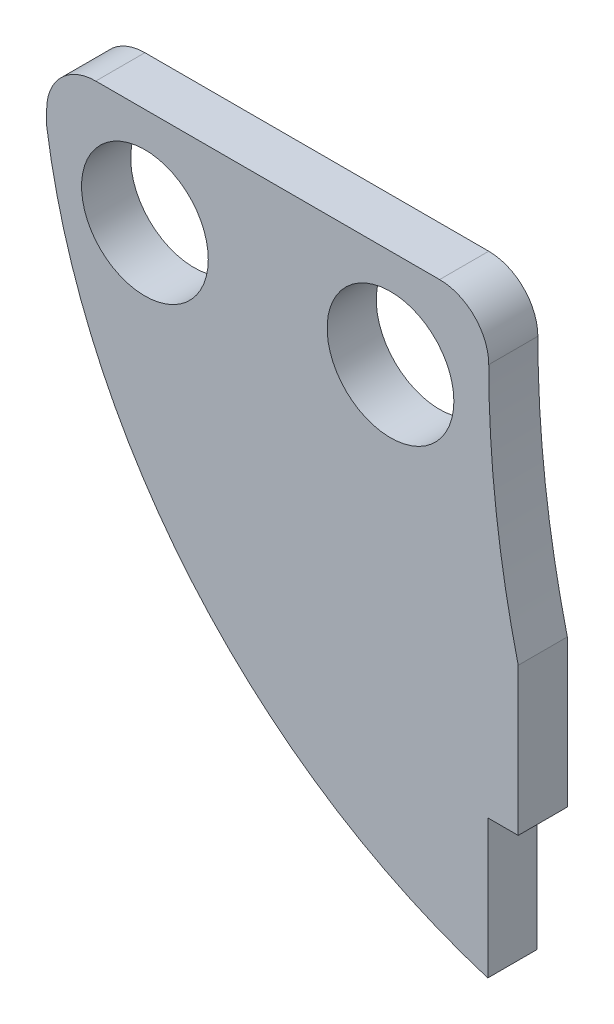
ISO-10303-21;
HEADER;
FILE_DESCRIPTION(('STEP AP214'),'2;1');
FILE_NAME('part.step','',(''),(''),'','','');
FILE_SCHEMA(('AUTOMOTIVE_DESIGN { 1 0 10303 214 1 1 1 1 }'));
ENDSEC;
DATA;
#1=APPLICATION_CONTEXT('core data for automotive mechanical design processes');
#2=APPLICATION_PROTOCOL_DEFINITION('international standard','automotive_design',2000,#1);
#3=PRODUCT_CONTEXT('',#1,'mechanical');
#4=PRODUCT('Part','Part','',(#3));
#5=PRODUCT_RELATED_PRODUCT_CATEGORY('part','',(#4));
#6=PRODUCT_DEFINITION_FORMATION('','',#4);
#7=PRODUCT_DEFINITION_CONTEXT('part definition',#1,'design');
#8=PRODUCT_DEFINITION('design','',#6,#7);
#9=PRODUCT_DEFINITION_SHAPE('','',#8);
#10=(LENGTH_UNIT() NAMED_UNIT(*) SI_UNIT(.MILLI.,.METRE.));
#11=(NAMED_UNIT(*) PLANE_ANGLE_UNIT() SI_UNIT($,.RADIAN.));
#12=(NAMED_UNIT(*) SI_UNIT($,.STERADIAN.) SOLID_ANGLE_UNIT());
#13=UNCERTAINTY_MEASURE_WITH_UNIT(LENGTH_MEASURE(1.E-05),#10,'distance_accuracy_value','');
#14=(GEOMETRIC_REPRESENTATION_CONTEXT(3) GLOBAL_UNCERTAINTY_ASSIGNED_CONTEXT((#13)) GLOBAL_UNIT_ASSIGNED_CONTEXT((#10,
#11,#12)) REPRESENTATION_CONTEXT('',''));
#15=CARTESIAN_POINT('',(0.,0.,0.));
#16=DIRECTION('',(0.,0.,1.));
#17=DIRECTION('',(1.,0.,0.));
#18=AXIS2_PLACEMENT_3D('',#15,#16,#17);
#19=CARTESIAN_POINT('',(38.7754736804659,5.55781789420011,5.));
#20=DIRECTION('',(0.,0.,1.));
#21=DIRECTION('',(1.,0.,0.));
#22=AXIS2_PLACEMENT_3D('',#19,#20,#21);
#23=PLANE('',#22);
#24=CARTESIAN_POINT('',(-15.3493449781659,-7.18340611353712,5.));
#25=DIRECTION('',(0.,0.,1.));
#26=DIRECTION('',(1.,0.,0.));
#27=AXIS2_PLACEMENT_3D('',#24,#25,#26);
#28=CIRCLE('',#27,6.45);
#29=CARTESIAN_POINT('',(-8.89934497816594,-7.18340611353712,5.));
#30=VERTEX_POINT('',#29);
#31=EDGE_CURVE('E187',#30,#30,#28,.T.);
#32=ORIENTED_EDGE('',*,*,#31,.F.);
#33=EDGE_LOOP('',(#32));
#34=FACE_BOUND('',#33,.T.);
#35=CARTESIAN_POINT('',(9.65065502183406,-7.18340611353712,5.));
#36=DIRECTION('',(0.,0.,1.));
#37=DIRECTION('',(1.,0.,0.));
#38=AXIS2_PLACEMENT_3D('',#35,#36,#37);
#39=CIRCLE('',#38,6.45);
#40=CARTESIAN_POINT('',(16.1006550218341,-7.18340611353712,5.));
#41=VERTEX_POINT('',#40);
#42=EDGE_CURVE('E135',#41,#41,#39,.T.);
#43=ORIENTED_EDGE('',*,*,#42,.F.);
#44=EDGE_LOOP('',(#43));
#45=FACE_BOUND('',#44,.T.);
#46=DIRECTION('',(-1.,0.,0.));
#47=VECTOR('',#46,1.);
#48=CARTESIAN_POINT('',(-25.3493449781659,2.81659388646288,5.));
#49=LINE('',#48,#47);
#50=CARTESIAN_POINT('',(14.650655021834,2.81659388646288,5.));
#51=VERTEX_POINT('',#50);
#52=CARTESIAN_POINT('',(-20.3493449781659,2.81659388646288,5.));
#53=VERTEX_POINT('',#52);
#54=EDGE_CURVE('E145',#51,#53,#49,.T.);
#55=ORIENTED_EDGE('',*,*,#54,.T.);
#56=CARTESIAN_POINT('',(-20.3493449781659,-2.18340611353712,5.));
#57=DIRECTION('',(0.,0.,1.));
#58=DIRECTION('',(1.,0.,0.));
#59=AXIS2_PLACEMENT_3D('',#56,#57,#58);
#60=CIRCLE('',#59,5.);
#61=CARTESIAN_POINT('',(-25.3493449781659,-2.18340611353712,5.));
#62=VERTEX_POINT('',#61);
#63=EDGE_CURVE('E11',#53,#62,#60,.T.);
#64=ORIENTED_EDGE('',*,*,#63,.T.);
#65=DIRECTION('',(0.,-1.,0.));
#66=VECTOR('',#65,1.);
#67=CARTESIAN_POINT('',(-25.3493449781659,-3.63340611353712,5.));
#68=LINE('',#67,#66);
#69=CARTESIAN_POINT('',(-25.3493449781659,-3.63340611353712,5.));
#70=VERTEX_POINT('',#69);
#71=EDGE_CURVE('E128',#62,#70,#68,.T.);
#72=ORIENTED_EDGE('',*,*,#71,.T.);
#73=CARTESIAN_POINT('',(38.7754736804659,5.55781789420011,5.));
#74=DIRECTION('',(0.,0.,1.));
#75=DIRECTION('',(1.,0.,0.));
#76=AXIS2_PLACEMENT_3D('',#73,#74,#75);
#77=CIRCLE('',#76,64.7801741797815);
#78=CARTESIAN_POINT('',(19.5506550218341,-56.3039418148928,5.));
#79=VERTEX_POINT('',#78);
#80=EDGE_CURVE('E124',#70,#79,#77,.T.);
#81=ORIENTED_EDGE('',*,*,#80,.T.);
#82=DIRECTION('',(0.,-1.,0.));
#83=VECTOR('',#82,1.);
#84=CARTESIAN_POINT('',(19.5506550218341,-42.1834061135371,5.));
#85=LINE('',#84,#83);
#86=CARTESIAN_POINT('',(19.5506550218341,-42.1834061135371,5.));
#87=VERTEX_POINT('',#86);
#88=EDGE_CURVE('E117',#87,#79,#85,.T.);
#89=ORIENTED_EDGE('',*,*,#88,.F.);
#90=DIRECTION('',(1.,0.,0.));
#91=VECTOR('',#90,1.);
#92=CARTESIAN_POINT('',(22.6506550218341,-42.1834061135371,5.));
#93=LINE('',#92,#91);
#94=CARTESIAN_POINT('',(22.6506550218341,-42.1834061135371,5.));
#95=VERTEX_POINT('',#94);
#96=EDGE_CURVE('E106',#87,#95,#93,.T.);
#97=ORIENTED_EDGE('',*,*,#96,.T.);
#98=DIRECTION('',(0.,1.,0.));
#99=VECTOR('',#98,1.);
#100=CARTESIAN_POINT('',(22.6506550218341,-27.1834061135371,5.));
#101=LINE('',#100,#99);
#102=CARTESIAN_POINT('',(22.6506550218341,-27.1834061135371,5.));
#103=VERTEX_POINT('',#102);
#104=EDGE_CURVE('E114',#95,#103,#101,.T.);
#105=ORIENTED_EDGE('',*,*,#104,.T.);
#106=CARTESIAN_POINT('',(125.317321688501,-2.18340611353712,5.));
#107=DIRECTION('',(0.,0.,-1.));
#108=DIRECTION('',(1.,0.,0.));
#109=AXIS2_PLACEMENT_3D('',#106,#107,#108);
#110=CIRCLE('',#109,105.666666666667);
#111=CARTESIAN_POINT('',(19.6506550218341,-2.1834061135371,5.));
#112=VERTEX_POINT('',#111);
#113=EDGE_CURVE('E123',#103,#112,#110,.T.);
#114=ORIENTED_EDGE('',*,*,#113,.T.);
#115=CARTESIAN_POINT('',(14.6506550218341,-2.18340611353712,5.));
#116=DIRECTION('',(0.,0.,1.));
#117=DIRECTION('',(1.,0.,0.));
#118=AXIS2_PLACEMENT_3D('',#115,#116,#117);
#119=CIRCLE('',#118,5.);
#120=EDGE_CURVE('E40',#112,#51,#119,.T.);
#121=ORIENTED_EDGE('',*,*,#120,.T.);
#122=EDGE_LOOP('',(#55,#64,#72,#81,#89,#97,#105,#114,#121));
#123=FACE_BOUND('',#122,.T.);
#124=ADVANCED_FACE('F32',(#34,#45,#123),#23,.T.);
#125=CARTESIAN_POINT('',(38.7754736804659,5.55781789420011,0.));
#126=DIRECTION('',(0.,0.,1.));
#127=DIRECTION('',(1.,0.,0.));
#128=AXIS2_PLACEMENT_3D('',#125,#126,#127);
#129=PLANE('',#128);
#130=CARTESIAN_POINT('',(-15.3493449781659,-7.18340611353712,0.));
#131=DIRECTION('',(0.,0.,1.));
#132=DIRECTION('',(1.,0.,0.));
#133=AXIS2_PLACEMENT_3D('',#130,#131,#132);
#134=CIRCLE('',#133,6.45);
#135=CARTESIAN_POINT('',(-8.89934497816594,-7.18340611353712,0.));
#136=VERTEX_POINT('',#135);
#137=EDGE_CURVE('E190',#136,#136,#134,.T.);
#138=ORIENTED_EDGE('',*,*,#137,.T.);
#139=EDGE_LOOP('',(#138));
#140=FACE_BOUND('',#139,.T.);
#141=CARTESIAN_POINT('',(9.65065502183406,-7.18340611353712,0.));
#142=DIRECTION('',(0.,0.,1.));
#143=DIRECTION('',(1.,0.,0.));
#144=AXIS2_PLACEMENT_3D('',#141,#142,#143);
#145=CIRCLE('',#144,6.45);
#146=CARTESIAN_POINT('',(16.1006550218341,-7.18340611353712,0.));
#147=VERTEX_POINT('',#146);
#148=EDGE_CURVE('E184',#147,#147,#145,.T.);
#149=ORIENTED_EDGE('',*,*,#148,.T.);
#150=EDGE_LOOP('',(#149));
#151=FACE_BOUND('',#150,.T.);
#152=DIRECTION('',(0.,-1.,0.));
#153=VECTOR('',#152,1.);
#154=CARTESIAN_POINT('',(-25.3493449781659,-3.63340611353712,0.));
#155=LINE('',#154,#153);
#156=CARTESIAN_POINT('',(-25.3493449781659,-2.18340611353712,0.));
#157=VERTEX_POINT('',#156);
#158=CARTESIAN_POINT('',(-25.3493449781659,-3.63340611353712,0.));
#159=VERTEX_POINT('',#158);
#160=EDGE_CURVE('E134',#157,#159,#155,.T.);
#161=ORIENTED_EDGE('',*,*,#160,.F.);
#162=CARTESIAN_POINT('',(-20.3493449781659,-2.18340611353712,0.));
#163=DIRECTION('',(0.,0.,1.));
#164=DIRECTION('',(1.,0.,0.));
#165=AXIS2_PLACEMENT_3D('',#162,#163,#164);
#166=CIRCLE('',#165,5.);
#167=CARTESIAN_POINT('',(-20.3493449781659,2.81659388646288,0.));
#168=VERTEX_POINT('',#167);
#169=EDGE_CURVE('E159',#157,#168,#166,.F.);
#170=ORIENTED_EDGE('',*,*,#169,.T.);
#171=DIRECTION('',(-1.,0.,0.));
#172=VECTOR('',#171,1.);
#173=CARTESIAN_POINT('',(-25.3493449781659,2.81659388646288,0.));
#174=LINE('',#173,#172);
#175=CARTESIAN_POINT('',(14.650655021834,2.81659388646288,0.));
#176=VERTEX_POINT('',#175);
#177=EDGE_CURVE('E132',#176,#168,#174,.T.);
#178=ORIENTED_EDGE('',*,*,#177,.F.);
#179=CARTESIAN_POINT('',(14.6506550218341,-2.18340611353712,0.));
#180=DIRECTION('',(0.,0.,1.));
#181=DIRECTION('',(1.,0.,0.));
#182=AXIS2_PLACEMENT_3D('',#179,#180,#181);
#183=CIRCLE('',#182,5.);
#184=CARTESIAN_POINT('',(19.6506550218341,-2.1834061135371,0.));
#185=VERTEX_POINT('',#184);
#186=EDGE_CURVE('E157',#176,#185,#183,.F.);
#187=ORIENTED_EDGE('',*,*,#186,.T.);
#188=CARTESIAN_POINT('',(125.317321688501,-2.18340611353712,0.));
#189=DIRECTION('',(0.,0.,-1.));
#190=DIRECTION('',(1.,0.,0.));
#191=AXIS2_PLACEMENT_3D('',#188,#189,#190);
#192=CIRCLE('',#191,105.666666666667);
#193=CARTESIAN_POINT('',(22.6506550218341,-27.1834061135371,0.));
#194=VERTEX_POINT('',#193);
#195=EDGE_CURVE('E142',#194,#185,#192,.T.);
#196=ORIENTED_EDGE('',*,*,#195,.F.);
#197=DIRECTION('',(0.,1.,0.));
#198=VECTOR('',#197,1.);
#199=CARTESIAN_POINT('',(22.6506550218341,-27.1834061135371,0.));
#200=LINE('',#199,#198);
#201=CARTESIAN_POINT('',(22.6506550218341,-42.1834061135371,0.));
#202=VERTEX_POINT('',#201);
#203=EDGE_CURVE('E140',#202,#194,#200,.T.);
#204=ORIENTED_EDGE('',*,*,#203,.F.);
#205=DIRECTION('',(-1.,0.,0.));
#206=VECTOR('',#205,1.);
#207=CARTESIAN_POINT('',(22.6506550218341,-42.1834061135371,0.));
#208=LINE('',#207,#206);
#209=CARTESIAN_POINT('',(19.5506550218341,-42.1834061135371,0.));
#210=VERTEX_POINT('',#209);
#211=EDGE_CURVE('E109',#202,#210,#208,.T.);
#212=ORIENTED_EDGE('',*,*,#211,.T.);
#213=DIRECTION('',(0.,-1.,0.));
#214=VECTOR('',#213,1.);
#215=CARTESIAN_POINT('',(19.5506550218341,-42.1834061135371,0.));
#216=LINE('',#215,#214);
#217=CARTESIAN_POINT('',(19.5506550218341,-56.3039418148928,0.));
#218=VERTEX_POINT('',#217);
#219=EDGE_CURVE('E193',#210,#218,#216,.T.);
#220=ORIENTED_EDGE('',*,*,#219,.T.);
#221=CARTESIAN_POINT('',(38.7754736804659,5.55781789420011,0.));
#222=DIRECTION('',(0.,0.,1.));
#223=DIRECTION('',(1.,0.,0.));
#224=AXIS2_PLACEMENT_3D('',#221,#222,#223);
#225=CIRCLE('',#224,64.7801741797815);
#226=EDGE_CURVE('E137',#159,#218,#225,.T.);
#227=ORIENTED_EDGE('',*,*,#226,.F.);
#228=EDGE_LOOP('',(#161,#170,#178,#187,#196,#204,#212,#220,#227));
#229=FACE_BOUND('',#228,.T.);
#230=ADVANCED_FACE('F170',(#140,#151,#229),#129,.F.);
#231=CARTESIAN_POINT('',(38.7754736804659,5.55781789420011,5.));
#232=DIRECTION('',(0.,0.,-1.));
#233=DIRECTION('',(-1.,0.,0.));
#234=AXIS2_PLACEMENT_3D('',#231,#232,#233);
#235=CYLINDRICAL_SURFACE('',#234,64.7801741797815);
#236=DIRECTION('',(0.,0.,-1.));
#237=VECTOR('',#236,1.);
#238=CARTESIAN_POINT('',(19.5506550218341,-56.3039418148928,5.));
#239=LINE('',#238,#237);
#240=EDGE_CURVE('E152',#79,#218,#239,.T.);
#241=ORIENTED_EDGE('',*,*,#240,.F.);
#242=ORIENTED_EDGE('',*,*,#80,.F.);
#243=DIRECTION('',(0.,0.,-1.));
#244=VECTOR('',#243,1.);
#245=CARTESIAN_POINT('',(-25.3493449781659,-3.63340611353712,5.));
#246=LINE('',#245,#244);
#247=EDGE_CURVE('E149',#70,#159,#246,.T.);
#248=ORIENTED_EDGE('',*,*,#247,.T.);
#249=ORIENTED_EDGE('',*,*,#226,.T.);
#250=EDGE_LOOP('',(#241,#242,#248,#249));
#251=FACE_BOUND('',#250,.T.);
#252=ADVANCED_FACE('F214',(#251),#235,.T.);
#253=CARTESIAN_POINT('',(22.6506550218341,-27.1834061135371,5.));
#254=DIRECTION('',(-1.,0.,0.));
#255=DIRECTION('',(0.,-1.,0.));
#256=AXIS2_PLACEMENT_3D('',#253,#254,#255);
#257=PLANE('',#256);
#258=DIRECTION('',(0.,0.,-1.));
#259=VECTOR('',#258,1.);
#260=CARTESIAN_POINT('',(22.6506550218341,-42.1834061135371,5.));
#261=LINE('',#260,#259);
#262=EDGE_CURVE('E102',#95,#202,#261,.T.);
#263=ORIENTED_EDGE('',*,*,#262,.T.);
#264=ORIENTED_EDGE('',*,*,#203,.T.);
#265=DIRECTION('',(0.,0.,-1.));
#266=VECTOR('',#265,1.);
#267=CARTESIAN_POINT('',(22.6506550218341,-27.1834061135371,5.));
#268=LINE('',#267,#266);
#269=EDGE_CURVE('E121',#103,#194,#268,.T.);
#270=ORIENTED_EDGE('',*,*,#269,.F.);
#271=ORIENTED_EDGE('',*,*,#104,.F.);
#272=EDGE_LOOP('',(#263,#264,#270,#271));
#273=FACE_BOUND('',#272,.T.);
#274=ADVANCED_FACE('F119',(#273),#257,.F.);
#275=CARTESIAN_POINT('',(-25.3493449781659,2.81659388646288,5.));
#276=DIRECTION('',(0.,-1.,0.));
#277=DIRECTION('',(0.,0.,-1.));
#278=AXIS2_PLACEMENT_3D('',#275,#276,#277);
#279=PLANE('',#278);
#280=ORIENTED_EDGE('',*,*,#177,.T.);
#281=DIRECTION('',(0.,0.,-1.));
#282=VECTOR('',#281,1.);
#283=CARTESIAN_POINT('',(-20.3493449781659,2.81659388646288,5.));
#284=LINE('',#283,#282);
#285=EDGE_CURVE('E47',#168,#53,#284,.F.);
#286=ORIENTED_EDGE('',*,*,#285,.T.);
#287=ORIENTED_EDGE('',*,*,#54,.F.);
#288=DIRECTION('',(0.,0.,-1.));
#289=VECTOR('',#288,1.);
#290=CARTESIAN_POINT('',(14.6506550218341,2.81659388646288,5.));
#291=LINE('',#290,#289);
#292=EDGE_CURVE('E161',#51,#176,#291,.T.);
#293=ORIENTED_EDGE('',*,*,#292,.T.);
#294=EDGE_LOOP('',(#280,#286,#287,#293));
#295=FACE_BOUND('',#294,.T.);
#296=ADVANCED_FACE('F166',(#295),#279,.F.);
#297=CARTESIAN_POINT('',(-25.3493449781659,-3.63340611353712,5.));
#298=DIRECTION('',(1.,0.,0.));
#299=DIRECTION('',(0.,0.,-1.));
#300=AXIS2_PLACEMENT_3D('',#297,#298,#299);
#301=PLANE('',#300);
#302=ORIENTED_EDGE('',*,*,#71,.F.);
#303=DIRECTION('',(0.,0.,-1.));
#304=VECTOR('',#303,1.);
#305=CARTESIAN_POINT('',(-25.3493449781659,-2.18340611353712,5.));
#306=LINE('',#305,#304);
#307=EDGE_CURVE('E154',#62,#157,#306,.T.);
#308=ORIENTED_EDGE('',*,*,#307,.T.);
#309=ORIENTED_EDGE('',*,*,#160,.T.);
#310=ORIENTED_EDGE('',*,*,#247,.F.);
#311=EDGE_LOOP('',(#302,#308,#309,#310));
#312=FACE_BOUND('',#311,.T.);
#313=ADVANCED_FACE('F179',(#312),#301,.F.);
#314=CARTESIAN_POINT('',(125.317321688501,-2.18340611353712,5.));
#315=DIRECTION('',(0.,0.,-1.));
#316=DIRECTION('',(-1.,0.,0.));
#317=AXIS2_PLACEMENT_3D('',#314,#315,#316);
#318=CYLINDRICAL_SURFACE('',#317,105.666666666667);
#319=ORIENTED_EDGE('',*,*,#195,.T.);
#320=DIRECTION('',(0.,0.,-1.));
#321=VECTOR('',#320,1.);
#322=CARTESIAN_POINT('',(19.6506550218341,-2.1834061135371,5.));
#323=LINE('',#322,#321);
#324=EDGE_CURVE('E126',#112,#185,#323,.T.);
#325=ORIENTED_EDGE('',*,*,#324,.F.);
#326=ORIENTED_EDGE('',*,*,#113,.F.);
#327=ORIENTED_EDGE('',*,*,#269,.T.);
#328=EDGE_LOOP('',(#319,#325,#326,#327));
#329=FACE_BOUND('',#328,.T.);
#330=ADVANCED_FACE('F202',(#329),#318,.F.);
#331=CARTESIAN_POINT('',(9.65065502183406,-7.18340611353712,5.));
#332=DIRECTION('',(0.,0.,-1.));
#333=DIRECTION('',(-1.,0.,0.));
#334=AXIS2_PLACEMENT_3D('',#331,#332,#333);
#335=CYLINDRICAL_SURFACE('',#334,6.45);
#336=ORIENTED_EDGE('',*,*,#42,.T.);
#337=EDGE_LOOP('',(#336));
#338=FACE_BOUND('',#337,.T.);
#339=ORIENTED_EDGE('',*,*,#148,.F.);
#340=EDGE_LOOP('',(#339));
#341=FACE_BOUND('',#340,.T.);
#342=ADVANCED_FACE('F220',(#338,#341),#335,.F.);
#343=CARTESIAN_POINT('',(-15.3493449781659,-7.18340611353712,5.));
#344=DIRECTION('',(0.,0.,-1.));
#345=DIRECTION('',(-1.,0.,0.));
#346=AXIS2_PLACEMENT_3D('',#343,#344,#345);
#347=CYLINDRICAL_SURFACE('',#346,6.45);
#348=ORIENTED_EDGE('',*,*,#31,.T.);
#349=EDGE_LOOP('',(#348));
#350=FACE_BOUND('',#349,.T.);
#351=ORIENTED_EDGE('',*,*,#137,.F.);
#352=EDGE_LOOP('',(#351));
#353=FACE_BOUND('',#352,.T.);
#354=ADVANCED_FACE('F253',(#350,#353),#347,.F.);
#355=CARTESIAN_POINT('',(19.5506550218341,-42.1834061135371,5.));
#356=DIRECTION('',(1.,0.,0.));
#357=DIRECTION('',(0.,0.,-1.));
#358=AXIS2_PLACEMENT_3D('',#355,#356,#357);
#359=PLANE('',#358);
#360=ORIENTED_EDGE('',*,*,#240,.T.);
#361=ORIENTED_EDGE('',*,*,#219,.F.);
#362=DIRECTION('',(0.,0.,1.));
#363=VECTOR('',#362,1.);
#364=CARTESIAN_POINT('',(19.5506550218341,-42.1834061135371,5.));
#365=LINE('',#364,#363);
#366=EDGE_CURVE('E199',#210,#87,#365,.T.);
#367=ORIENTED_EDGE('',*,*,#366,.T.);
#368=ORIENTED_EDGE('',*,*,#88,.T.);
#369=EDGE_LOOP('',(#360,#361,#367,#368));
#370=FACE_BOUND('',#369,.T.);
#371=ADVANCED_FACE('F260',(#370),#359,.T.);
#372=CARTESIAN_POINT('',(0.,-42.1834061135371,0.));
#373=DIRECTION('',(0.,-1.,0.));
#374=DIRECTION('',(0.,0.,-1.));
#375=AXIS2_PLACEMENT_3D('',#372,#373,#374);
#376=PLANE('',#375);
#377=ORIENTED_EDGE('',*,*,#96,.F.);
#378=ORIENTED_EDGE('',*,*,#366,.F.);
#379=ORIENTED_EDGE('',*,*,#211,.F.);
#380=ORIENTED_EDGE('',*,*,#262,.F.);
#381=EDGE_LOOP('',(#377,#378,#379,#380));
#382=FACE_BOUND('',#381,.T.);
#383=ADVANCED_FACE('F104',(#382),#376,.T.);
#384=CARTESIAN_POINT('',(-20.3493449781659,-2.18340611353712,5.));
#385=DIRECTION('',(0.,0.,-1.));
#386=DIRECTION('',(-1.,0.,0.));
#387=AXIS2_PLACEMENT_3D('',#384,#385,#386);
#388=CYLINDRICAL_SURFACE('',#387,5.);
#389=ORIENTED_EDGE('',*,*,#63,.F.);
#390=ORIENTED_EDGE('',*,*,#285,.F.);
#391=ORIENTED_EDGE('',*,*,#169,.F.);
#392=ORIENTED_EDGE('',*,*,#307,.F.);
#393=EDGE_LOOP('',(#389,#390,#391,#392));
#394=FACE_BOUND('',#393,.T.);
#395=ADVANCED_FACE('F176',(#394),#388,.T.);
#396=CARTESIAN_POINT('',(14.6506550218341,-2.18340611353712,5.));
#397=DIRECTION('',(0.,0.,-1.));
#398=DIRECTION('',(-1.,0.,0.));
#399=AXIS2_PLACEMENT_3D('',#396,#397,#398);
#400=CYLINDRICAL_SURFACE('',#399,5.);
#401=ORIENTED_EDGE('',*,*,#120,.F.);
#402=ORIENTED_EDGE('',*,*,#324,.T.);
#403=ORIENTED_EDGE('',*,*,#186,.F.);
#404=ORIENTED_EDGE('',*,*,#292,.F.);
#405=EDGE_LOOP('',(#401,#402,#403,#404));
#406=FACE_BOUND('',#405,.T.);
#407=ADVANCED_FACE('F34',(#406),#400,.T.);
#408=CLOSED_SHELL('',(#124,#230,#252,#274,#296,#313,#330,#342,#354,#371,#383,#395,#407));
#409=MANIFOLD_SOLID_BREP('B2',#408);
#410=ADVANCED_BREP_SHAPE_REPRESENTATION('',(#18,#409),#14);
#411=SHAPE_DEFINITION_REPRESENTATION(#9,#410);
ENDSEC;
END-ISO-10303-21;
